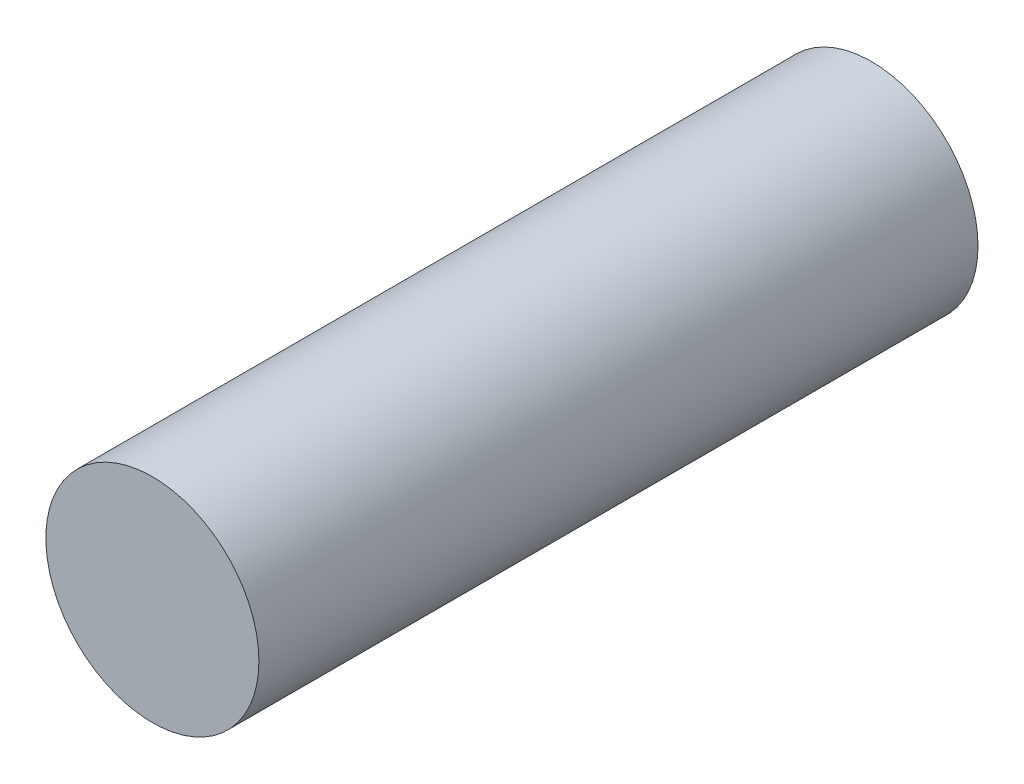
ISO-10303-21;
HEADER;
FILE_DESCRIPTION(('STEP AP214'),'2;1');
FILE_NAME('part.step','',(''),(''),'','','');
FILE_SCHEMA(('AUTOMOTIVE_DESIGN { 1 0 10303 214 1 1 1 1 }'));
ENDSEC;
DATA;
#1=APPLICATION_CONTEXT('core data for automotive mechanical design processes');
#2=APPLICATION_PROTOCOL_DEFINITION('international standard','automotive_design',2000,#1);
#3=PRODUCT_CONTEXT('',#1,'mechanical');
#4=PRODUCT('Part','Part','',(#3));
#5=PRODUCT_RELATED_PRODUCT_CATEGORY('part','',(#4));
#6=PRODUCT_DEFINITION_FORMATION('','',#4);
#7=PRODUCT_DEFINITION_CONTEXT('part definition',#1,'design');
#8=PRODUCT_DEFINITION('design','',#6,#7);
#9=PRODUCT_DEFINITION_SHAPE('','',#8);
#10=(LENGTH_UNIT() NAMED_UNIT(*) SI_UNIT(.MILLI.,.METRE.));
#11=(NAMED_UNIT(*) PLANE_ANGLE_UNIT() SI_UNIT($,.RADIAN.));
#12=(NAMED_UNIT(*) SI_UNIT($,.STERADIAN.) SOLID_ANGLE_UNIT());
#13=UNCERTAINTY_MEASURE_WITH_UNIT(LENGTH_MEASURE(1.E-05),#10,'distance_accuracy_value','');
#14=(GEOMETRIC_REPRESENTATION_CONTEXT(3) GLOBAL_UNCERTAINTY_ASSIGNED_CONTEXT((#13)) GLOBAL_UNIT_ASSIGNED_CONTEXT((#10,
#11,#12)) REPRESENTATION_CONTEXT('',''));
#15=CARTESIAN_POINT('',(0.,0.,0.));
#16=DIRECTION('',(0.,0.,1.));
#17=DIRECTION('',(1.,0.,0.));
#18=AXIS2_PLACEMENT_3D('',#15,#16,#17);
#19=CARTESIAN_POINT('',(0.,0.,270.));
#20=DIRECTION('',(0.,0.,-1.));
#21=DIRECTION('',(-1.,0.,0.));
#22=AXIS2_PLACEMENT_3D('',#19,#20,#21);
#23=CYLINDRICAL_SURFACE('',#22,40.);
#24=CARTESIAN_POINT('',(0.,0.,270.));
#25=DIRECTION('',(0.,0.,1.));
#26=DIRECTION('',(1.,0.,0.));
#27=AXIS2_PLACEMENT_3D('',#24,#25,#26);
#28=CIRCLE('',#27,40.);
#29=CARTESIAN_POINT('',(40.,0.,270.));
#30=VERTEX_POINT('',#29);
#31=EDGE_CURVE('E10',#30,#30,#28,.T.);
#32=ORIENTED_EDGE('',*,*,#31,.F.);
#33=EDGE_LOOP('',(#32));
#34=FACE_BOUND('',#33,.T.);
#35=CARTESIAN_POINT('',(0.,0.,0.));
#36=DIRECTION('',(0.,0.,1.));
#37=DIRECTION('',(1.,0.,0.));
#38=AXIS2_PLACEMENT_3D('',#35,#36,#37);
#39=CIRCLE('',#38,40.);
#40=CARTESIAN_POINT('',(40.,0.,0.));
#41=VERTEX_POINT('',#40);
#42=EDGE_CURVE('E36',#41,#41,#39,.T.);
#43=ORIENTED_EDGE('',*,*,#42,.T.);
#44=EDGE_LOOP('',(#43));
#45=FACE_BOUND('',#44,.T.);
#46=ADVANCED_FACE('F33',(#34,#45),#23,.T.);
#47=CARTESIAN_POINT('',(0.,0.,270.));
#48=DIRECTION('',(0.,0.,1.));
#49=DIRECTION('',(1.,0.,0.));
#50=AXIS2_PLACEMENT_3D('',#47,#48,#49);
#51=PLANE('',#50);
#52=ORIENTED_EDGE('',*,*,#31,.T.);
#53=EDGE_LOOP('',(#52));
#54=FACE_BOUND('',#53,.T.);
#55=ADVANCED_FACE('F48',(#54),#51,.T.);
#56=CARTESIAN_POINT('',(0.,0.,0.));
#57=DIRECTION('',(0.,0.,1.));
#58=DIRECTION('',(1.,0.,0.));
#59=AXIS2_PLACEMENT_3D('',#56,#57,#58);
#60=PLANE('',#59);
#61=ORIENTED_EDGE('',*,*,#42,.F.);
#62=EDGE_LOOP('',(#61));
#63=FACE_BOUND('',#62,.T.);
#64=ADVANCED_FACE('F46',(#63),#60,.F.);
#65=CLOSED_SHELL('',(#46,#55,#64));
#66=MANIFOLD_SOLID_BREP('B2',#65);
#67=ADVANCED_BREP_SHAPE_REPRESENTATION('',(#18,#66),#14);
#68=SHAPE_DEFINITION_REPRESENTATION(#9,#67);
ENDSEC;
END-ISO-10303-21;
